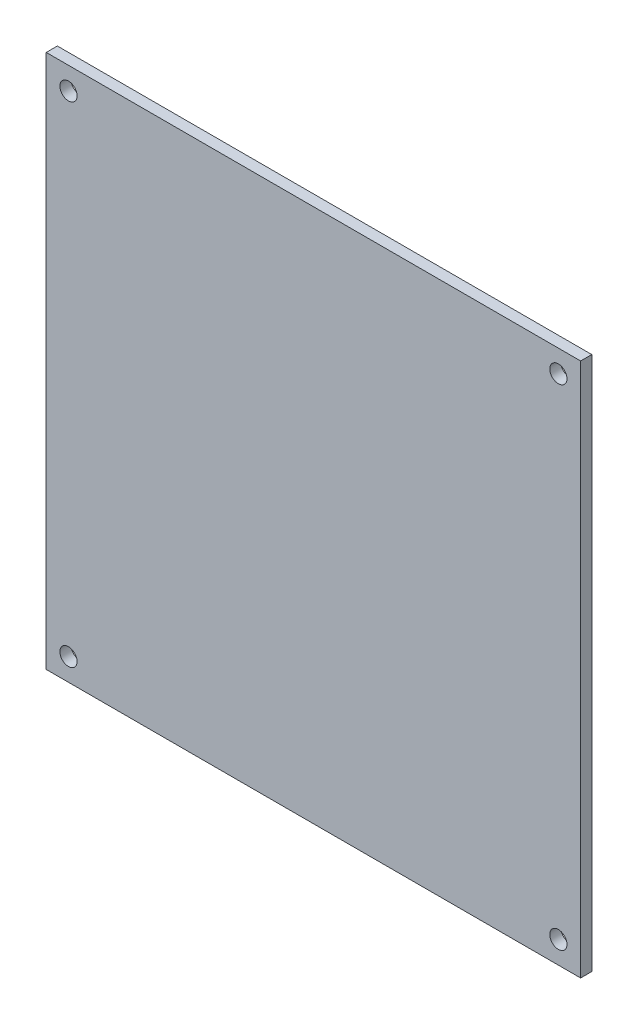
ISO-10303-21;
HEADER;
FILE_DESCRIPTION(('STEP AP214'),'2;1');
FILE_NAME('part.step','',(''),(''),'','','');
FILE_SCHEMA(('AUTOMOTIVE_DESIGN { 1 0 10303 214 1 1 1 1 }'));
ENDSEC;
DATA;
#1=APPLICATION_CONTEXT('core data for automotive mechanical design processes');
#2=APPLICATION_PROTOCOL_DEFINITION('international standard','automotive_design',2000,#1);
#3=PRODUCT_CONTEXT('',#1,'mechanical');
#4=PRODUCT('Part','Part','',(#3));
#5=PRODUCT_RELATED_PRODUCT_CATEGORY('part','',(#4));
#6=PRODUCT_DEFINITION_FORMATION('','',#4);
#7=PRODUCT_DEFINITION_CONTEXT('part definition',#1,'design');
#8=PRODUCT_DEFINITION('design','',#6,#7);
#9=PRODUCT_DEFINITION_SHAPE('','',#8);
#10=(LENGTH_UNIT() NAMED_UNIT(*) SI_UNIT(.MILLI.,.METRE.));
#11=(NAMED_UNIT(*) PLANE_ANGLE_UNIT() SI_UNIT($,.RADIAN.));
#12=(NAMED_UNIT(*) SI_UNIT($,.STERADIAN.) SOLID_ANGLE_UNIT());
#13=UNCERTAINTY_MEASURE_WITH_UNIT(LENGTH_MEASURE(1.E-05),#10,'distance_accuracy_value','');
#14=(GEOMETRIC_REPRESENTATION_CONTEXT(3) GLOBAL_UNCERTAINTY_ASSIGNED_CONTEXT((#13)) GLOBAL_UNIT_ASSIGNED_CONTEXT((#10,
#11,#12)) REPRESENTATION_CONTEXT('',''));
#15=CARTESIAN_POINT('',(0.,0.,0.));
#16=DIRECTION('',(0.,0.,1.));
#17=DIRECTION('',(1.,0.,0.));
#18=AXIS2_PLACEMENT_3D('',#15,#16,#17);
#19=CARTESIAN_POINT('',(76.2,-76.2,3.175));
#20=DIRECTION('',(-1.,0.,0.));
#21=DIRECTION('',(0.,0.,1.));
#22=AXIS2_PLACEMENT_3D('',#19,#20,#21);
#23=PLANE('',#22);
#24=DIRECTION('',(0.,1.,0.));
#25=VECTOR('',#24,1.);
#26=CARTESIAN_POINT('',(76.2,-76.2,0.));
#27=LINE('',#26,#25);
#28=CARTESIAN_POINT('',(76.2,-76.2,0.));
#29=VERTEX_POINT('',#28);
#30=CARTESIAN_POINT('',(76.2,76.2,0.));
#31=VERTEX_POINT('',#30);
#32=EDGE_CURVE('E109',#29,#31,#27,.T.);
#33=ORIENTED_EDGE('',*,*,#32,.T.);
#34=DIRECTION('',(0.,0.,-1.));
#35=VECTOR('',#34,1.);
#36=CARTESIAN_POINT('',(76.2,76.2,3.175));
#37=LINE('',#36,#35);
#38=CARTESIAN_POINT('',(76.2,76.2,3.175));
#39=VERTEX_POINT('',#38);
#40=EDGE_CURVE('E11',#39,#31,#37,.T.);
#41=ORIENTED_EDGE('',*,*,#40,.F.);
#42=DIRECTION('',(0.,1.,0.));
#43=VECTOR('',#42,1.);
#44=CARTESIAN_POINT('',(76.2,-76.2,3.175));
#45=LINE('',#44,#43);
#46=CARTESIAN_POINT('',(76.2,-76.2,3.175));
#47=VERTEX_POINT('',#46);
#48=EDGE_CURVE('E93',#47,#39,#45,.T.);
#49=ORIENTED_EDGE('',*,*,#48,.F.);
#50=DIRECTION('',(0.,0.,-1.));
#51=VECTOR('',#50,1.);
#52=CARTESIAN_POINT('',(76.2,-76.2,3.175));
#53=LINE('',#52,#51);
#54=EDGE_CURVE('E105',#47,#29,#53,.T.);
#55=ORIENTED_EDGE('',*,*,#54,.T.);
#56=EDGE_LOOP('',(#33,#41,#49,#55));
#57=FACE_BOUND('',#56,.T.);
#58=ADVANCED_FACE('F41',(#57),#23,.F.);
#59=CARTESIAN_POINT('',(-76.2,76.2,3.175));
#60=DIRECTION('',(0.,-1.,0.));
#61=DIRECTION('',(0.,0.,-1.));
#62=AXIS2_PLACEMENT_3D('',#59,#60,#61);
#63=PLANE('',#62);
#64=DIRECTION('',(-1.,0.,0.));
#65=VECTOR('',#64,1.);
#66=CARTESIAN_POINT('',(-76.2,76.2,0.));
#67=LINE('',#66,#65);
#68=CARTESIAN_POINT('',(-76.2,76.2,0.));
#69=VERTEX_POINT('',#68);
#70=EDGE_CURVE('E98',#31,#69,#67,.T.);
#71=ORIENTED_EDGE('',*,*,#70,.T.);
#72=DIRECTION('',(0.,0.,-1.));
#73=VECTOR('',#72,1.);
#74=CARTESIAN_POINT('',(-76.2,76.2,3.175));
#75=LINE('',#74,#73);
#76=CARTESIAN_POINT('',(-76.2,76.2,3.175));
#77=VERTEX_POINT('',#76);
#78=EDGE_CURVE('E50',#77,#69,#75,.T.);
#79=ORIENTED_EDGE('',*,*,#78,.F.);
#80=DIRECTION('',(-1.,0.,0.));
#81=VECTOR('',#80,1.);
#82=CARTESIAN_POINT('',(-76.2,76.2,3.175));
#83=LINE('',#82,#81);
#84=EDGE_CURVE('E88',#39,#77,#83,.T.);
#85=ORIENTED_EDGE('',*,*,#84,.F.);
#86=ORIENTED_EDGE('',*,*,#40,.T.);
#87=EDGE_LOOP('',(#71,#79,#85,#86));
#88=FACE_BOUND('',#87,.T.);
#89=ADVANCED_FACE('F97',(#88),#63,.F.);
#90=CARTESIAN_POINT('',(-76.2,-76.2,3.175));
#91=DIRECTION('',(1.,0.,0.));
#92=DIRECTION('',(0.,0.,-1.));
#93=AXIS2_PLACEMENT_3D('',#90,#91,#92);
#94=PLANE('',#93);
#95=DIRECTION('',(0.,-1.,0.));
#96=VECTOR('',#95,1.);
#97=CARTESIAN_POINT('',(-76.2,-76.2,0.));
#98=LINE('',#97,#96);
#99=CARTESIAN_POINT('',(-76.2,-76.2,0.));
#100=VERTEX_POINT('',#99);
#101=EDGE_CURVE('E75',#69,#100,#98,.T.);
#102=ORIENTED_EDGE('',*,*,#101,.T.);
#103=DIRECTION('',(0.,0.,-1.));
#104=VECTOR('',#103,1.);
#105=CARTESIAN_POINT('',(-76.2,-76.2,3.175));
#106=LINE('',#105,#104);
#107=CARTESIAN_POINT('',(-76.2,-76.2,3.175));
#108=VERTEX_POINT('',#107);
#109=EDGE_CURVE('E100',#108,#100,#106,.T.);
#110=ORIENTED_EDGE('',*,*,#109,.F.);
#111=DIRECTION('',(0.,-1.,0.));
#112=VECTOR('',#111,1.);
#113=CARTESIAN_POINT('',(-76.2,-76.2,3.175));
#114=LINE('',#113,#112);
#115=EDGE_CURVE('E91',#77,#108,#114,.T.);
#116=ORIENTED_EDGE('',*,*,#115,.F.);
#117=ORIENTED_EDGE('',*,*,#78,.T.);
#118=EDGE_LOOP('',(#102,#110,#116,#117));
#119=FACE_BOUND('',#118,.T.);
#120=ADVANCED_FACE('F101',(#119),#94,.F.);
#121=CARTESIAN_POINT('',(-76.2,-76.2,3.175));
#122=DIRECTION('',(0.,1.,0.));
#123=DIRECTION('',(0.,0.,1.));
#124=AXIS2_PLACEMENT_3D('',#121,#122,#123);
#125=PLANE('',#124);
#126=DIRECTION('',(1.,0.,0.));
#127=VECTOR('',#126,1.);
#128=CARTESIAN_POINT('',(-76.2,-76.2,0.));
#129=LINE('',#128,#127);
#130=EDGE_CURVE('E81',#100,#29,#129,.T.);
#131=ORIENTED_EDGE('',*,*,#130,.T.);
#132=ORIENTED_EDGE('',*,*,#54,.F.);
#133=DIRECTION('',(1.,0.,0.));
#134=VECTOR('',#133,1.);
#135=CARTESIAN_POINT('',(-76.2,-76.2,3.175));
#136=LINE('',#135,#134);
#137=EDGE_CURVE('E58',#108,#47,#136,.T.);
#138=ORIENTED_EDGE('',*,*,#137,.F.);
#139=ORIENTED_EDGE('',*,*,#109,.T.);
#140=EDGE_LOOP('',(#131,#132,#138,#139));
#141=FACE_BOUND('',#140,.T.);
#142=ADVANCED_FACE('F123',(#141),#125,.F.);
#143=CARTESIAN_POINT('',(0.,0.,3.175));
#144=DIRECTION('',(0.,0.,-1.));
#145=DIRECTION('',(-1.,0.,0.));
#146=AXIS2_PLACEMENT_3D('',#143,#144,#145);
#147=PLANE('',#146);
#148=CARTESIAN_POINT('',(69.85,-69.85,3.175));
#149=DIRECTION('',(0.,0.,1.));
#150=DIRECTION('',(1.,0.,0.));
#151=AXIS2_PLACEMENT_3D('',#148,#149,#150);
#152=CIRCLE('',#151,2.45745);
#153=CARTESIAN_POINT('',(72.30745,-69.85,3.175));
#154=VERTEX_POINT('',#153);
#155=EDGE_CURVE('E157',#154,#154,#152,.T.);
#156=ORIENTED_EDGE('',*,*,#155,.F.);
#157=EDGE_LOOP('',(#156));
#158=FACE_BOUND('',#157,.T.);
#159=CARTESIAN_POINT('',(-69.85,-69.85,3.175));
#160=DIRECTION('',(0.,0.,1.));
#161=DIRECTION('',(1.,0.,0.));
#162=AXIS2_PLACEMENT_3D('',#159,#160,#161);
#163=CIRCLE('',#162,2.45745);
#164=CARTESIAN_POINT('',(-67.39255,-69.85,3.175));
#165=VERTEX_POINT('',#164);
#166=EDGE_CURVE('E149',#165,#165,#163,.T.);
#167=ORIENTED_EDGE('',*,*,#166,.F.);
#168=EDGE_LOOP('',(#167));
#169=FACE_BOUND('',#168,.T.);
#170=CARTESIAN_POINT('',(-69.85,69.85,3.175));
#171=DIRECTION('',(0.,0.,1.));
#172=DIRECTION('',(1.,0.,0.));
#173=AXIS2_PLACEMENT_3D('',#170,#171,#172);
#174=CIRCLE('',#173,2.45745);
#175=CARTESIAN_POINT('',(-67.39255,69.85,3.175));
#176=VERTEX_POINT('',#175);
#177=EDGE_CURVE('E141',#176,#176,#174,.T.);
#178=ORIENTED_EDGE('',*,*,#177,.F.);
#179=EDGE_LOOP('',(#178));
#180=FACE_BOUND('',#179,.T.);
#181=CARTESIAN_POINT('',(69.85,69.85,3.175));
#182=DIRECTION('',(0.,0.,1.));
#183=DIRECTION('',(1.,0.,0.));
#184=AXIS2_PLACEMENT_3D('',#181,#182,#183);
#185=CIRCLE('',#184,2.45745);
#186=CARTESIAN_POINT('',(72.30745,69.85,3.175));
#187=VERTEX_POINT('',#186);
#188=EDGE_CURVE('E133',#187,#187,#185,.T.);
#189=ORIENTED_EDGE('',*,*,#188,.F.);
#190=EDGE_LOOP('',(#189));
#191=FACE_BOUND('',#190,.T.);
#192=ORIENTED_EDGE('',*,*,#48,.T.);
#193=ORIENTED_EDGE('',*,*,#84,.T.);
#194=ORIENTED_EDGE('',*,*,#115,.T.);
#195=ORIENTED_EDGE('',*,*,#137,.T.);
#196=EDGE_LOOP('',(#192,#193,#194,#195));
#197=FACE_BOUND('',#196,.T.);
#198=ADVANCED_FACE('F89',(#158,#169,#180,#191,#197),#147,.F.);
#199=CARTESIAN_POINT('',(0.,0.,0.));
#200=DIRECTION('',(0.,0.,-1.));
#201=DIRECTION('',(-1.,0.,0.));
#202=AXIS2_PLACEMENT_3D('',#199,#200,#201);
#203=PLANE('',#202);
#204=CARTESIAN_POINT('',(69.85,-69.85,0.));
#205=DIRECTION('',(0.,0.,1.));
#206=DIRECTION('',(1.,0.,0.));
#207=AXIS2_PLACEMENT_3D('',#204,#205,#206);
#208=CIRCLE('',#207,2.45745);
#209=CARTESIAN_POINT('',(72.30745,-69.85,0.));
#210=VERTEX_POINT('',#209);
#211=EDGE_CURVE('E153',#210,#210,#208,.T.);
#212=ORIENTED_EDGE('',*,*,#211,.T.);
#213=EDGE_LOOP('',(#212));
#214=FACE_BOUND('',#213,.T.);
#215=CARTESIAN_POINT('',(-69.85,-69.85,0.));
#216=DIRECTION('',(0.,0.,1.));
#217=DIRECTION('',(1.,0.,0.));
#218=AXIS2_PLACEMENT_3D('',#215,#216,#217);
#219=CIRCLE('',#218,2.45745);
#220=CARTESIAN_POINT('',(-67.39255,-69.85,0.));
#221=VERTEX_POINT('',#220);
#222=EDGE_CURVE('E145',#221,#221,#219,.T.);
#223=ORIENTED_EDGE('',*,*,#222,.T.);
#224=EDGE_LOOP('',(#223));
#225=FACE_BOUND('',#224,.T.);
#226=CARTESIAN_POINT('',(-69.85,69.85,0.));
#227=DIRECTION('',(0.,0.,1.));
#228=DIRECTION('',(1.,0.,0.));
#229=AXIS2_PLACEMENT_3D('',#226,#227,#228);
#230=CIRCLE('',#229,2.45745);
#231=CARTESIAN_POINT('',(-67.39255,69.85,0.));
#232=VERTEX_POINT('',#231);
#233=EDGE_CURVE('E137',#232,#232,#230,.T.);
#234=ORIENTED_EDGE('',*,*,#233,.T.);
#235=EDGE_LOOP('',(#234));
#236=FACE_BOUND('',#235,.T.);
#237=CARTESIAN_POINT('',(69.85,69.85,0.));
#238=DIRECTION('',(0.,0.,1.));
#239=DIRECTION('',(1.,0.,0.));
#240=AXIS2_PLACEMENT_3D('',#237,#238,#239);
#241=CIRCLE('',#240,2.45745);
#242=CARTESIAN_POINT('',(72.30745,69.85,0.));
#243=VERTEX_POINT('',#242);
#244=EDGE_CURVE('E113',#243,#243,#241,.T.);
#245=ORIENTED_EDGE('',*,*,#244,.T.);
#246=EDGE_LOOP('',(#245));
#247=FACE_BOUND('',#246,.T.);
#248=ORIENTED_EDGE('',*,*,#32,.F.);
#249=ORIENTED_EDGE('',*,*,#130,.F.);
#250=ORIENTED_EDGE('',*,*,#101,.F.);
#251=ORIENTED_EDGE('',*,*,#70,.F.);
#252=EDGE_LOOP('',(#248,#249,#250,#251));
#253=FACE_BOUND('',#252,.T.);
#254=ADVANCED_FACE('F126',(#214,#225,#236,#247,#253),#203,.T.);
#255=CARTESIAN_POINT('',(69.85,69.85,3.175));
#256=DIRECTION('',(0.,0.,1.));
#257=DIRECTION('',(1.,0.,0.));
#258=AXIS2_PLACEMENT_3D('',#255,#256,#257);
#259=CYLINDRICAL_SURFACE('',#258,2.45745);
#260=ORIENTED_EDGE('',*,*,#244,.F.);
#261=EDGE_LOOP('',(#260));
#262=FACE_BOUND('',#261,.T.);
#263=ORIENTED_EDGE('',*,*,#188,.T.);
#264=EDGE_LOOP('',(#263));
#265=FACE_BOUND('',#264,.T.);
#266=ADVANCED_FACE('F173',(#262,#265),#259,.F.);
#267=CARTESIAN_POINT('',(-69.85,69.85,3.175));
#268=DIRECTION('',(0.,0.,1.));
#269=DIRECTION('',(1.,0.,0.));
#270=AXIS2_PLACEMENT_3D('',#267,#268,#269);
#271=CYLINDRICAL_SURFACE('',#270,2.45745);
#272=ORIENTED_EDGE('',*,*,#233,.F.);
#273=EDGE_LOOP('',(#272));
#274=FACE_BOUND('',#273,.T.);
#275=ORIENTED_EDGE('',*,*,#177,.T.);
#276=EDGE_LOOP('',(#275));
#277=FACE_BOUND('',#276,.T.);
#278=ADVANCED_FACE('F175',(#274,#277),#271,.F.);
#279=CARTESIAN_POINT('',(-69.85,-69.85,3.175));
#280=DIRECTION('',(0.,0.,1.));
#281=DIRECTION('',(1.,0.,0.));
#282=AXIS2_PLACEMENT_3D('',#279,#280,#281);
#283=CYLINDRICAL_SURFACE('',#282,2.45745);
#284=ORIENTED_EDGE('',*,*,#222,.F.);
#285=EDGE_LOOP('',(#284));
#286=FACE_BOUND('',#285,.T.);
#287=ORIENTED_EDGE('',*,*,#166,.T.);
#288=EDGE_LOOP('',(#287));
#289=FACE_BOUND('',#288,.T.);
#290=ADVANCED_FACE('F182',(#286,#289),#283,.F.);
#291=CARTESIAN_POINT('',(69.85,-69.85,3.175));
#292=DIRECTION('',(0.,0.,1.));
#293=DIRECTION('',(1.,0.,0.));
#294=AXIS2_PLACEMENT_3D('',#291,#292,#293);
#295=CYLINDRICAL_SURFACE('',#294,2.45745);
#296=ORIENTED_EDGE('',*,*,#211,.F.);
#297=EDGE_LOOP('',(#296));
#298=FACE_BOUND('',#297,.T.);
#299=ORIENTED_EDGE('',*,*,#155,.T.);
#300=EDGE_LOOP('',(#299));
#301=FACE_BOUND('',#300,.T.);
#302=ADVANCED_FACE('F162',(#298,#301),#295,.F.);
#303=CLOSED_SHELL('',(#58,#89,#120,#142,#198,#254,#266,#278,#290,#302));
#304=MANIFOLD_SOLID_BREP('B2',#303);
#305=ADVANCED_BREP_SHAPE_REPRESENTATION('',(#18,#304),#14);
#306=SHAPE_DEFINITION_REPRESENTATION(#9,#305);
ENDSEC;
END-ISO-10303-21;
